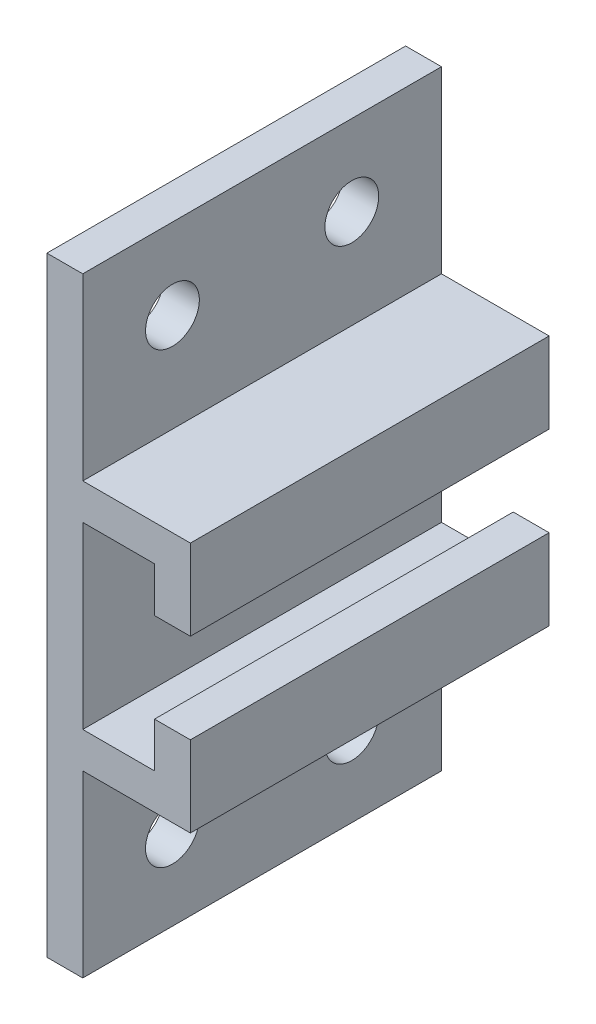
ISO-10303-21;
HEADER;
FILE_DESCRIPTION(('STEP AP214'),'2;1');
FILE_NAME('part.step','',(''),(''),'','','');
FILE_SCHEMA(('AUTOMOTIVE_DESIGN { 1 0 10303 214 1 1 1 1 }'));
ENDSEC;
DATA;
#1=APPLICATION_CONTEXT('core data for automotive mechanical design processes');
#2=APPLICATION_PROTOCOL_DEFINITION('international standard','automotive_design',2000,#1);
#3=PRODUCT_CONTEXT('',#1,'mechanical');
#4=PRODUCT('Part','Part','',(#3));
#5=PRODUCT_RELATED_PRODUCT_CATEGORY('part','',(#4));
#6=PRODUCT_DEFINITION_FORMATION('','',#4);
#7=PRODUCT_DEFINITION_CONTEXT('part definition',#1,'design');
#8=PRODUCT_DEFINITION('design','',#6,#7);
#9=PRODUCT_DEFINITION_SHAPE('','',#8);
#10=(LENGTH_UNIT() NAMED_UNIT(*) SI_UNIT(.MILLI.,.METRE.));
#11=(NAMED_UNIT(*) PLANE_ANGLE_UNIT() SI_UNIT($,.RADIAN.));
#12=(NAMED_UNIT(*) SI_UNIT($,.STERADIAN.) SOLID_ANGLE_UNIT());
#13=UNCERTAINTY_MEASURE_WITH_UNIT(LENGTH_MEASURE(1.E-05),#10,'distance_accuracy_value','');
#14=(GEOMETRIC_REPRESENTATION_CONTEXT(3) GLOBAL_UNCERTAINTY_ASSIGNED_CONTEXT((#13)) GLOBAL_UNIT_ASSIGNED_CONTEXT((#10,
#11,#12)) REPRESENTATION_CONTEXT('',''));
#15=CARTESIAN_POINT('',(0.,0.,0.));
#16=DIRECTION('',(0.,0.,1.));
#17=DIRECTION('',(1.,0.,0.));
#18=AXIS2_PLACEMENT_3D('',#15,#16,#17);
#19=CARTESIAN_POINT('',(0.,17.,20.));
#20=DIRECTION('',(0.,-1.,0.));
#21=DIRECTION('',(0.,0.,-1.));
#22=AXIS2_PLACEMENT_3D('',#19,#20,#21);
#23=PLANE('',#22);
#24=DIRECTION('',(-1.,0.,0.));
#25=VECTOR('',#24,1.);
#26=CARTESIAN_POINT('',(0.,17.,0.));
#27=LINE('',#26,#25);
#28=CARTESIAN_POINT('',(1.99999999999999,17.,0.));
#29=VERTEX_POINT('',#28);
#30=CARTESIAN_POINT('',(0.,17.,0.));
#31=VERTEX_POINT('',#30);
#32=EDGE_CURVE('E179',#29,#31,#27,.T.);
#33=ORIENTED_EDGE('',*,*,#32,.T.);
#34=DIRECTION('',(0.,0.,-1.));
#35=VECTOR('',#34,1.);
#36=CARTESIAN_POINT('',(0.,17.,20.));
#37=LINE('',#36,#35);
#38=CARTESIAN_POINT('',(0.,17.,20.));
#39=VERTEX_POINT('',#38);
#40=EDGE_CURVE('E11',#39,#31,#37,.T.);
#41=ORIENTED_EDGE('',*,*,#40,.F.);
#42=DIRECTION('',(-1.,0.,0.));
#43=VECTOR('',#42,1.);
#44=CARTESIAN_POINT('',(0.,17.,20.));
#45=LINE('',#44,#43);
#46=CARTESIAN_POINT('',(1.99999999999999,17.,20.));
#47=VERTEX_POINT('',#46);
#48=EDGE_CURVE('E210',#47,#39,#45,.T.);
#49=ORIENTED_EDGE('',*,*,#48,.F.);
#50=DIRECTION('',(0.,0.,-1.));
#51=VECTOR('',#50,1.);
#52=CARTESIAN_POINT('',(1.99999999999999,17.,20.));
#53=LINE('',#52,#51);
#54=EDGE_CURVE('E175',#47,#29,#53,.T.);
#55=ORIENTED_EDGE('',*,*,#54,.T.);
#56=EDGE_LOOP('',(#33,#41,#49,#55));
#57=FACE_BOUND('',#56,.T.);
#58=ADVANCED_FACE('F33',(#57),#23,.F.);
#59=CARTESIAN_POINT('',(0.,17.,20.));
#60=DIRECTION('',(1.,0.,0.));
#61=DIRECTION('',(0.,1.,0.));
#62=AXIS2_PLACEMENT_3D('',#59,#60,#61);
#63=PLANE('',#62);
#64=CARTESIAN_POINT('',(0.,-12.5,5.));
#65=DIRECTION('',(-1.,0.,0.));
#66=DIRECTION('',(0.,-1.,0.));
#67=AXIS2_PLACEMENT_3D('',#64,#65,#66);
#68=CIRCLE('',#67,1.5);
#69=CARTESIAN_POINT('',(0.,-14.,5.));
#70=VERTEX_POINT('',#69);
#71=EDGE_CURVE('E252',#70,#70,#68,.T.);
#72=ORIENTED_EDGE('',*,*,#71,.F.);
#73=EDGE_LOOP('',(#72));
#74=FACE_BOUND('',#73,.T.);
#75=CARTESIAN_POINT('',(0.,-12.5,15.));
#76=DIRECTION('',(-1.,0.,0.));
#77=DIRECTION('',(0.,-1.,0.));
#78=AXIS2_PLACEMENT_3D('',#75,#76,#77);
#79=CIRCLE('',#78,1.5);
#80=CARTESIAN_POINT('',(0.,-14.,15.));
#81=VERTEX_POINT('',#80);
#82=EDGE_CURVE('E451',#81,#81,#79,.T.);
#83=ORIENTED_EDGE('',*,*,#82,.F.);
#84=EDGE_LOOP('',(#83));
#85=FACE_BOUND('',#84,.T.);
#86=CARTESIAN_POINT('',(0.,12.5,15.));
#87=DIRECTION('',(-1.,0.,0.));
#88=DIRECTION('',(0.,-1.,0.));
#89=AXIS2_PLACEMENT_3D('',#86,#87,#88);
#90=CIRCLE('',#89,1.5);
#91=CARTESIAN_POINT('',(0.,11.,15.));
#92=VERTEX_POINT('',#91);
#93=EDGE_CURVE('E265',#92,#92,#90,.T.);
#94=ORIENTED_EDGE('',*,*,#93,.F.);
#95=EDGE_LOOP('',(#94));
#96=FACE_BOUND('',#95,.T.);
#97=CARTESIAN_POINT('',(0.,12.5,5.));
#98=DIRECTION('',(-1.,0.,0.));
#99=DIRECTION('',(0.,-1.,0.));
#100=AXIS2_PLACEMENT_3D('',#97,#98,#99);
#101=CIRCLE('',#100,1.5);
#102=CARTESIAN_POINT('',(0.,11.,5.));
#103=VERTEX_POINT('',#102);
#104=EDGE_CURVE('E248',#103,#103,#101,.T.);
#105=ORIENTED_EDGE('',*,*,#104,.F.);
#106=EDGE_LOOP('',(#105));
#107=FACE_BOUND('',#106,.T.);
#108=DIRECTION('',(0.,-1.,0.));
#109=VECTOR('',#108,1.);
#110=CARTESIAN_POINT('',(0.,17.,0.));
#111=LINE('',#110,#109);
#112=CARTESIAN_POINT('',(0.,-17.,0.));
#113=VERTEX_POINT('',#112);
#114=EDGE_CURVE('E182',#31,#113,#111,.T.);
#115=ORIENTED_EDGE('',*,*,#114,.T.);
#116=DIRECTION('',(0.,0.,-1.));
#117=VECTOR('',#116,1.);
#118=CARTESIAN_POINT('',(0.,-17.,20.));
#119=LINE('',#118,#117);
#120=CARTESIAN_POINT('',(0.,-17.,20.));
#121=VERTEX_POINT('',#120);
#122=EDGE_CURVE('E42',#121,#113,#119,.T.);
#123=ORIENTED_EDGE('',*,*,#122,.F.);
#124=DIRECTION('',(0.,-1.,0.));
#125=VECTOR('',#124,1.);
#126=CARTESIAN_POINT('',(0.,17.,20.));
#127=LINE('',#126,#125);
#128=EDGE_CURVE('E118',#39,#121,#127,.T.);
#129=ORIENTED_EDGE('',*,*,#128,.F.);
#130=ORIENTED_EDGE('',*,*,#40,.T.);
#131=EDGE_LOOP('',(#115,#123,#129,#130));
#132=FACE_BOUND('',#131,.T.);
#133=ADVANCED_FACE('F318',(#74,#85,#96,#107,#132),#63,.F.);
#134=CARTESIAN_POINT('',(0.,-17.,20.));
#135=DIRECTION('',(0.,1.,0.));
#136=DIRECTION('',(0.,0.,1.));
#137=AXIS2_PLACEMENT_3D('',#134,#135,#136);
#138=PLANE('',#137);
#139=DIRECTION('',(1.,0.,0.));
#140=VECTOR('',#139,1.);
#141=CARTESIAN_POINT('',(0.,-17.,0.));
#142=LINE('',#141,#140);
#143=CARTESIAN_POINT('',(2.,-17.,0.));
#144=VERTEX_POINT('',#143);
#145=EDGE_CURVE('E185',#113,#144,#142,.T.);
#146=ORIENTED_EDGE('',*,*,#145,.T.);
#147=DIRECTION('',(0.,0.,-1.));
#148=VECTOR('',#147,1.);
#149=CARTESIAN_POINT('',(2.,-17.,20.));
#150=LINE('',#149,#148);
#151=CARTESIAN_POINT('',(2.,-17.,20.));
#152=VERTEX_POINT('',#151);
#153=EDGE_CURVE('E241',#152,#144,#150,.T.);
#154=ORIENTED_EDGE('',*,*,#153,.F.);
#155=DIRECTION('',(1.,0.,0.));
#156=VECTOR('',#155,1.);
#157=CARTESIAN_POINT('',(0.,-17.,20.));
#158=LINE('',#157,#156);
#159=EDGE_CURVE('E269',#121,#152,#158,.T.);
#160=ORIENTED_EDGE('',*,*,#159,.F.);
#161=ORIENTED_EDGE('',*,*,#122,.T.);
#162=EDGE_LOOP('',(#146,#154,#160,#161));
#163=FACE_BOUND('',#162,.T.);
#164=ADVANCED_FACE('F322',(#163),#138,.F.);
#165=CARTESIAN_POINT('',(2.,-17.,20.));
#166=DIRECTION('',(-1.,0.,0.));
#167=DIRECTION('',(0.,0.,1.));
#168=AXIS2_PLACEMENT_3D('',#165,#166,#167);
#169=PLANE('',#168);
#170=CARTESIAN_POINT('',(2.,-12.5,5.));
#171=DIRECTION('',(-1.,0.,0.));
#172=DIRECTION('',(0.,0.,1.));
#173=AXIS2_PLACEMENT_3D('',#170,#171,#172);
#174=CIRCLE('',#173,1.5);
#175=CARTESIAN_POINT('',(2.,-12.5,6.5));
#176=VERTEX_POINT('',#175);
#177=EDGE_CURVE('E36',#176,#176,#174,.T.);
#178=ORIENTED_EDGE('',*,*,#177,.T.);
#179=EDGE_LOOP('',(#178));
#180=FACE_BOUND('',#179,.T.);
#181=CARTESIAN_POINT('',(2.,-12.5,15.));
#182=DIRECTION('',(-1.,0.,0.));
#183=DIRECTION('',(0.,0.,1.));
#184=AXIS2_PLACEMENT_3D('',#181,#182,#183);
#185=CIRCLE('',#184,1.5);
#186=CARTESIAN_POINT('',(2.,-12.5,16.5));
#187=VERTEX_POINT('',#186);
#188=EDGE_CURVE('E251',#187,#187,#185,.T.);
#189=ORIENTED_EDGE('',*,*,#188,.T.);
#190=EDGE_LOOP('',(#189));
#191=FACE_BOUND('',#190,.T.);
#192=DIRECTION('',(0.,1.,0.));
#193=VECTOR('',#192,1.);
#194=CARTESIAN_POINT('',(2.,-17.,0.));
#195=LINE('',#194,#193);
#196=CARTESIAN_POINT('',(2.,-7.,0.));
#197=VERTEX_POINT('',#196);
#198=EDGE_CURVE('E187',#144,#197,#195,.T.);
#199=ORIENTED_EDGE('',*,*,#198,.T.);
#200=DIRECTION('',(0.,0.,-1.));
#201=VECTOR('',#200,1.);
#202=CARTESIAN_POINT('',(2.,-7.,20.));
#203=LINE('',#202,#201);
#204=CARTESIAN_POINT('',(2.,-7.,20.));
#205=VERTEX_POINT('',#204);
#206=EDGE_CURVE('E238',#205,#197,#203,.T.);
#207=ORIENTED_EDGE('',*,*,#206,.F.);
#208=DIRECTION('',(0.,1.,0.));
#209=VECTOR('',#208,1.);
#210=CARTESIAN_POINT('',(2.,-17.,20.));
#211=LINE('',#210,#209);
#212=EDGE_CURVE('E271',#152,#205,#211,.T.);
#213=ORIENTED_EDGE('',*,*,#212,.F.);
#214=ORIENTED_EDGE('',*,*,#153,.T.);
#215=EDGE_LOOP('',(#199,#207,#213,#214));
#216=FACE_BOUND('',#215,.T.);
#217=ADVANCED_FACE('F327',(#180,#191,#216),#169,.F.);
#218=CARTESIAN_POINT('',(2.,-7.,20.));
#219=DIRECTION('',(0.,1.,0.));
#220=DIRECTION('',(0.,0.,1.));
#221=AXIS2_PLACEMENT_3D('',#218,#219,#220);
#222=PLANE('',#221);
#223=DIRECTION('',(1.,0.,0.));
#224=VECTOR('',#223,1.);
#225=CARTESIAN_POINT('',(2.,-7.,0.));
#226=LINE('',#225,#224);
#227=CARTESIAN_POINT('',(8.,-7.,0.));
#228=VERTEX_POINT('',#227);
#229=EDGE_CURVE('E189',#197,#228,#226,.T.);
#230=ORIENTED_EDGE('',*,*,#229,.T.);
#231=DIRECTION('',(0.,0.,-1.));
#232=VECTOR('',#231,1.);
#233=CARTESIAN_POINT('',(8.,-7.,20.));
#234=LINE('',#233,#232);
#235=CARTESIAN_POINT('',(8.,-7.,20.));
#236=VERTEX_POINT('',#235);
#237=EDGE_CURVE('E235',#236,#228,#234,.T.);
#238=ORIENTED_EDGE('',*,*,#237,.F.);
#239=DIRECTION('',(1.,0.,0.));
#240=VECTOR('',#239,1.);
#241=CARTESIAN_POINT('',(2.,-7.,20.));
#242=LINE('',#241,#240);
#243=EDGE_CURVE('E273',#205,#236,#242,.T.);
#244=ORIENTED_EDGE('',*,*,#243,.F.);
#245=ORIENTED_EDGE('',*,*,#206,.T.);
#246=EDGE_LOOP('',(#230,#238,#244,#245));
#247=FACE_BOUND('',#246,.T.);
#248=ADVANCED_FACE('F335',(#247),#222,.F.);
#249=CARTESIAN_POINT('',(8.,-7.,20.));
#250=DIRECTION('',(-1.,0.,0.));
#251=DIRECTION('',(0.,0.,1.));
#252=AXIS2_PLACEMENT_3D('',#249,#250,#251);
#253=PLANE('',#252);
#254=DIRECTION('',(0.,1.,0.));
#255=VECTOR('',#254,1.);
#256=CARTESIAN_POINT('',(8.,-7.,0.));
#257=LINE('',#256,#255);
#258=CARTESIAN_POINT('',(8.,-2.5,0.));
#259=VERTEX_POINT('',#258);
#260=EDGE_CURVE('E191',#228,#259,#257,.T.);
#261=ORIENTED_EDGE('',*,*,#260,.T.);
#262=DIRECTION('',(0.,0.,-1.));
#263=VECTOR('',#262,1.);
#264=CARTESIAN_POINT('',(8.,-2.5,20.));
#265=LINE('',#264,#263);
#266=CARTESIAN_POINT('',(8.,-2.5,20.));
#267=VERTEX_POINT('',#266);
#268=EDGE_CURVE('E232',#267,#259,#265,.T.);
#269=ORIENTED_EDGE('',*,*,#268,.F.);
#270=DIRECTION('',(0.,1.,0.));
#271=VECTOR('',#270,1.);
#272=CARTESIAN_POINT('',(8.,-7.,20.));
#273=LINE('',#272,#271);
#274=EDGE_CURVE('E275',#236,#267,#273,.T.);
#275=ORIENTED_EDGE('',*,*,#274,.F.);
#276=ORIENTED_EDGE('',*,*,#237,.T.);
#277=EDGE_LOOP('',(#261,#269,#275,#276));
#278=FACE_BOUND('',#277,.T.);
#279=ADVANCED_FACE('F338',(#278),#253,.F.);
#280=CARTESIAN_POINT('',(8.,-2.5,20.));
#281=DIRECTION('',(0.,-1.,0.));
#282=DIRECTION('',(1.,0.,0.));
#283=AXIS2_PLACEMENT_3D('',#280,#281,#282);
#284=PLANE('',#283);
#285=DIRECTION('',(-1.,0.,0.));
#286=VECTOR('',#285,1.);
#287=CARTESIAN_POINT('',(8.,-2.5,0.));
#288=LINE('',#287,#286);
#289=CARTESIAN_POINT('',(6.,-2.5,0.));
#290=VERTEX_POINT('',#289);
#291=EDGE_CURVE('E193',#259,#290,#288,.T.);
#292=ORIENTED_EDGE('',*,*,#291,.T.);
#293=DIRECTION('',(0.,0.,-1.));
#294=VECTOR('',#293,1.);
#295=CARTESIAN_POINT('',(6.,-2.5,20.));
#296=LINE('',#295,#294);
#297=CARTESIAN_POINT('',(6.,-2.5,20.));
#298=VERTEX_POINT('',#297);
#299=EDGE_CURVE('E229',#298,#290,#296,.T.);
#300=ORIENTED_EDGE('',*,*,#299,.F.);
#301=DIRECTION('',(-1.,0.,0.));
#302=VECTOR('',#301,1.);
#303=CARTESIAN_POINT('',(8.,-2.5,20.));
#304=LINE('',#303,#302);
#305=EDGE_CURVE('E277',#267,#298,#304,.T.);
#306=ORIENTED_EDGE('',*,*,#305,.F.);
#307=ORIENTED_EDGE('',*,*,#268,.T.);
#308=EDGE_LOOP('',(#292,#300,#306,#307));
#309=FACE_BOUND('',#308,.T.);
#310=ADVANCED_FACE('F342',(#309),#284,.F.);
#311=CARTESIAN_POINT('',(6.,-2.5,20.));
#312=DIRECTION('',(1.,0.,0.));
#313=DIRECTION('',(0.,1.,0.));
#314=AXIS2_PLACEMENT_3D('',#311,#312,#313);
#315=PLANE('',#314);
#316=DIRECTION('',(0.,-1.,0.));
#317=VECTOR('',#316,1.);
#318=CARTESIAN_POINT('',(6.,-2.5,0.));
#319=LINE('',#318,#317);
#320=CARTESIAN_POINT('',(6.,-5.,0.));
#321=VERTEX_POINT('',#320);
#322=EDGE_CURVE('E195',#290,#321,#319,.T.);
#323=ORIENTED_EDGE('',*,*,#322,.T.);
#324=DIRECTION('',(0.,0.,-1.));
#325=VECTOR('',#324,1.);
#326=CARTESIAN_POINT('',(6.,-5.,20.));
#327=LINE('',#326,#325);
#328=CARTESIAN_POINT('',(6.,-5.,20.));
#329=VERTEX_POINT('',#328);
#330=EDGE_CURVE('E226',#329,#321,#327,.T.);
#331=ORIENTED_EDGE('',*,*,#330,.F.);
#332=DIRECTION('',(0.,-1.,0.));
#333=VECTOR('',#332,1.);
#334=CARTESIAN_POINT('',(6.,-2.5,20.));
#335=LINE('',#334,#333);
#336=EDGE_CURVE('E279',#298,#329,#335,.T.);
#337=ORIENTED_EDGE('',*,*,#336,.F.);
#338=ORIENTED_EDGE('',*,*,#299,.T.);
#339=EDGE_LOOP('',(#323,#331,#337,#338));
#340=FACE_BOUND('',#339,.T.);
#341=ADVANCED_FACE('F346',(#340),#315,.F.);
#342=CARTESIAN_POINT('',(6.,-5.,20.));
#343=DIRECTION('',(0.,-1.,0.));
#344=DIRECTION('',(1.,0.,0.));
#345=AXIS2_PLACEMENT_3D('',#342,#343,#344);
#346=PLANE('',#345);
#347=DIRECTION('',(-1.,0.,0.));
#348=VECTOR('',#347,1.);
#349=CARTESIAN_POINT('',(6.,-5.,0.));
#350=LINE('',#349,#348);
#351=CARTESIAN_POINT('',(2.,-5.,0.));
#352=VERTEX_POINT('',#351);
#353=EDGE_CURVE('E197',#321,#352,#350,.T.);
#354=ORIENTED_EDGE('',*,*,#353,.T.);
#355=DIRECTION('',(0.,0.,-1.));
#356=VECTOR('',#355,1.);
#357=CARTESIAN_POINT('',(2.,-5.,20.));
#358=LINE('',#357,#356);
#359=CARTESIAN_POINT('',(2.,-5.,20.));
#360=VERTEX_POINT('',#359);
#361=EDGE_CURVE('E223',#360,#352,#358,.T.);
#362=ORIENTED_EDGE('',*,*,#361,.F.);
#363=DIRECTION('',(-1.,0.,0.));
#364=VECTOR('',#363,1.);
#365=CARTESIAN_POINT('',(6.,-5.,20.));
#366=LINE('',#365,#364);
#367=EDGE_CURVE('E281',#329,#360,#366,.T.);
#368=ORIENTED_EDGE('',*,*,#367,.F.);
#369=ORIENTED_EDGE('',*,*,#330,.T.);
#370=EDGE_LOOP('',(#354,#362,#368,#369));
#371=FACE_BOUND('',#370,.T.);
#372=ADVANCED_FACE('F350',(#371),#346,.F.);
#373=CARTESIAN_POINT('',(2.,-5.,20.));
#374=DIRECTION('',(-1.,0.,0.));
#375=DIRECTION('',(0.,-1.,0.));
#376=AXIS2_PLACEMENT_3D('',#373,#374,#375);
#377=PLANE('',#376);
#378=DIRECTION('',(0.,1.,0.));
#379=VECTOR('',#378,1.);
#380=CARTESIAN_POINT('',(2.,-5.,0.));
#381=LINE('',#380,#379);
#382=CARTESIAN_POINT('',(2.,5.,0.));
#383=VERTEX_POINT('',#382);
#384=EDGE_CURVE('E199',#352,#383,#381,.T.);
#385=ORIENTED_EDGE('',*,*,#384,.T.);
#386=DIRECTION('',(0.,0.,-1.));
#387=VECTOR('',#386,1.);
#388=CARTESIAN_POINT('',(2.,5.,20.));
#389=LINE('',#388,#387);
#390=CARTESIAN_POINT('',(2.,5.,20.));
#391=VERTEX_POINT('',#390);
#392=EDGE_CURVE('E220',#391,#383,#389,.T.);
#393=ORIENTED_EDGE('',*,*,#392,.F.);
#394=DIRECTION('',(0.,1.,0.));
#395=VECTOR('',#394,1.);
#396=CARTESIAN_POINT('',(2.,-5.,20.));
#397=LINE('',#396,#395);
#398=EDGE_CURVE('E283',#360,#391,#397,.T.);
#399=ORIENTED_EDGE('',*,*,#398,.F.);
#400=ORIENTED_EDGE('',*,*,#361,.T.);
#401=EDGE_LOOP('',(#385,#393,#399,#400));
#402=FACE_BOUND('',#401,.T.);
#403=ADVANCED_FACE('F354',(#402),#377,.F.);
#404=CARTESIAN_POINT('',(2.,5.,20.));
#405=DIRECTION('',(0.,1.,0.));
#406=DIRECTION('',(0.,0.,1.));
#407=AXIS2_PLACEMENT_3D('',#404,#405,#406);
#408=PLANE('',#407);
#409=DIRECTION('',(1.,0.,0.));
#410=VECTOR('',#409,1.);
#411=CARTESIAN_POINT('',(2.,5.,0.));
#412=LINE('',#411,#410);
#413=CARTESIAN_POINT('',(6.,5.,0.));
#414=VERTEX_POINT('',#413);
#415=EDGE_CURVE('E201',#383,#414,#412,.T.);
#416=ORIENTED_EDGE('',*,*,#415,.T.);
#417=DIRECTION('',(0.,0.,-1.));
#418=VECTOR('',#417,1.);
#419=CARTESIAN_POINT('',(6.,5.,20.));
#420=LINE('',#419,#418);
#421=CARTESIAN_POINT('',(6.,5.,20.));
#422=VERTEX_POINT('',#421);
#423=EDGE_CURVE('E217',#422,#414,#420,.T.);
#424=ORIENTED_EDGE('',*,*,#423,.F.);
#425=DIRECTION('',(1.,0.,0.));
#426=VECTOR('',#425,1.);
#427=CARTESIAN_POINT('',(2.,5.,20.));
#428=LINE('',#427,#426);
#429=EDGE_CURVE('E285',#391,#422,#428,.T.);
#430=ORIENTED_EDGE('',*,*,#429,.F.);
#431=ORIENTED_EDGE('',*,*,#392,.T.);
#432=EDGE_LOOP('',(#416,#424,#430,#431));
#433=FACE_BOUND('',#432,.T.);
#434=ADVANCED_FACE('F358',(#433),#408,.F.);
#435=CARTESIAN_POINT('',(6.,5.,20.));
#436=DIRECTION('',(1.,0.,0.));
#437=DIRECTION('',(0.,1.,0.));
#438=AXIS2_PLACEMENT_3D('',#435,#436,#437);
#439=PLANE('',#438);
#440=DIRECTION('',(0.,-1.,0.));
#441=VECTOR('',#440,1.);
#442=CARTESIAN_POINT('',(6.,5.,0.));
#443=LINE('',#442,#441);
#444=CARTESIAN_POINT('',(6.,2.5,0.));
#445=VERTEX_POINT('',#444);
#446=EDGE_CURVE('E203',#414,#445,#443,.T.);
#447=ORIENTED_EDGE('',*,*,#446,.T.);
#448=DIRECTION('',(0.,0.,-1.));
#449=VECTOR('',#448,1.);
#450=CARTESIAN_POINT('',(6.,2.5,20.));
#451=LINE('',#450,#449);
#452=CARTESIAN_POINT('',(6.,2.5,20.));
#453=VERTEX_POINT('',#452);
#454=EDGE_CURVE('E214',#453,#445,#451,.T.);
#455=ORIENTED_EDGE('',*,*,#454,.F.);
#456=DIRECTION('',(0.,-1.,0.));
#457=VECTOR('',#456,1.);
#458=CARTESIAN_POINT('',(6.,5.,20.));
#459=LINE('',#458,#457);
#460=EDGE_CURVE('E287',#422,#453,#459,.T.);
#461=ORIENTED_EDGE('',*,*,#460,.F.);
#462=ORIENTED_EDGE('',*,*,#423,.T.);
#463=EDGE_LOOP('',(#447,#455,#461,#462));
#464=FACE_BOUND('',#463,.T.);
#465=ADVANCED_FACE('F293',(#464),#439,.F.);
#466=CARTESIAN_POINT('',(6.,2.5,20.));
#467=DIRECTION('',(0.,1.,0.));
#468=DIRECTION('',(-1.,0.,0.));
#469=AXIS2_PLACEMENT_3D('',#466,#467,#468);
#470=PLANE('',#469);
#471=DIRECTION('',(1.,0.,0.));
#472=VECTOR('',#471,1.);
#473=CARTESIAN_POINT('',(6.,2.5,0.));
#474=LINE('',#473,#472);
#475=CARTESIAN_POINT('',(8.,2.5,0.));
#476=VERTEX_POINT('',#475);
#477=EDGE_CURVE('E205',#445,#476,#474,.T.);
#478=ORIENTED_EDGE('',*,*,#477,.T.);
#479=DIRECTION('',(0.,0.,-1.));
#480=VECTOR('',#479,1.);
#481=CARTESIAN_POINT('',(8.,2.5,20.));
#482=LINE('',#481,#480);
#483=CARTESIAN_POINT('',(8.,2.5,20.));
#484=VERTEX_POINT('',#483);
#485=EDGE_CURVE('E170',#484,#476,#482,.T.);
#486=ORIENTED_EDGE('',*,*,#485,.F.);
#487=DIRECTION('',(1.,0.,0.));
#488=VECTOR('',#487,1.);
#489=CARTESIAN_POINT('',(6.,2.5,20.));
#490=LINE('',#489,#488);
#491=EDGE_CURVE('E161',#453,#484,#490,.T.);
#492=ORIENTED_EDGE('',*,*,#491,.F.);
#493=ORIENTED_EDGE('',*,*,#454,.T.);
#494=EDGE_LOOP('',(#478,#486,#492,#493));
#495=FACE_BOUND('',#494,.T.);
#496=ADVANCED_FACE('F297',(#495),#470,.F.);
#497=CARTESIAN_POINT('',(8.,2.5,20.));
#498=DIRECTION('',(-1.,0.,0.));
#499=DIRECTION('',(0.,-1.,0.));
#500=AXIS2_PLACEMENT_3D('',#497,#498,#499);
#501=PLANE('',#500);
#502=DIRECTION('',(0.,1.,0.));
#503=VECTOR('',#502,1.);
#504=CARTESIAN_POINT('',(8.,2.5,0.));
#505=LINE('',#504,#503);
#506=CARTESIAN_POINT('',(8.,7.,0.));
#507=VERTEX_POINT('',#506);
#508=EDGE_CURVE('E169',#476,#507,#505,.T.);
#509=ORIENTED_EDGE('',*,*,#508,.T.);
#510=DIRECTION('',(0.,0.,-1.));
#511=VECTOR('',#510,1.);
#512=CARTESIAN_POINT('',(8.,7.,20.));
#513=LINE('',#512,#511);
#514=CARTESIAN_POINT('',(8.,7.,20.));
#515=VERTEX_POINT('',#514);
#516=EDGE_CURVE('E166',#515,#507,#513,.T.);
#517=ORIENTED_EDGE('',*,*,#516,.F.);
#518=DIRECTION('',(0.,1.,0.));
#519=VECTOR('',#518,1.);
#520=CARTESIAN_POINT('',(8.,2.5,20.));
#521=LINE('',#520,#519);
#522=EDGE_CURVE('E155',#484,#515,#521,.T.);
#523=ORIENTED_EDGE('',*,*,#522,.F.);
#524=ORIENTED_EDGE('',*,*,#485,.T.);
#525=EDGE_LOOP('',(#509,#517,#523,#524));
#526=FACE_BOUND('',#525,.T.);
#527=ADVANCED_FACE('F167',(#526),#501,.F.);
#528=CARTESIAN_POINT('',(2.,7.,20.));
#529=DIRECTION('',(0.,-1.,0.));
#530=DIRECTION('',(1.,0.,0.));
#531=AXIS2_PLACEMENT_3D('',#528,#529,#530);
#532=PLANE('',#531);
#533=DIRECTION('',(-1.,0.,0.));
#534=VECTOR('',#533,1.);
#535=CARTESIAN_POINT('',(2.,7.,0.));
#536=LINE('',#535,#534);
#537=CARTESIAN_POINT('',(2.,7.,0.));
#538=VERTEX_POINT('',#537);
#539=EDGE_CURVE('E104',#507,#538,#536,.T.);
#540=ORIENTED_EDGE('',*,*,#539,.T.);
#541=DIRECTION('',(0.,0.,-1.));
#542=VECTOR('',#541,1.);
#543=CARTESIAN_POINT('',(2.,7.,20.));
#544=LINE('',#543,#542);
#545=CARTESIAN_POINT('',(2.,7.,20.));
#546=VERTEX_POINT('',#545);
#547=EDGE_CURVE('E171',#546,#538,#544,.T.);
#548=ORIENTED_EDGE('',*,*,#547,.F.);
#549=DIRECTION('',(-1.,0.,0.));
#550=VECTOR('',#549,1.);
#551=CARTESIAN_POINT('',(2.,7.,20.));
#552=LINE('',#551,#550);
#553=EDGE_CURVE('E159',#515,#546,#552,.T.);
#554=ORIENTED_EDGE('',*,*,#553,.F.);
#555=ORIENTED_EDGE('',*,*,#516,.T.);
#556=EDGE_LOOP('',(#540,#548,#554,#555));
#557=FACE_BOUND('',#556,.T.);
#558=ADVANCED_FACE('F173',(#557),#532,.F.);
#559=CARTESIAN_POINT('',(1.99999999999999,17.,20.));
#560=DIRECTION('',(-1.,0.,0.));
#561=DIRECTION('',(0.,-1.,0.));
#562=AXIS2_PLACEMENT_3D('',#559,#560,#561);
#563=PLANE('',#562);
#564=CARTESIAN_POINT('',(2.,12.5,15.));
#565=DIRECTION('',(-1.,0.,0.));
#566=DIRECTION('',(0.,-1.,0.));
#567=AXIS2_PLACEMENT_3D('',#564,#565,#566);
#568=CIRCLE('',#567,1.5);
#569=CARTESIAN_POINT('',(2.,11.,15.));
#570=VERTEX_POINT('',#569);
#571=EDGE_CURVE('E249',#570,#570,#568,.T.);
#572=ORIENTED_EDGE('',*,*,#571,.T.);
#573=EDGE_LOOP('',(#572));
#574=FACE_BOUND('',#573,.T.);
#575=CARTESIAN_POINT('',(2.,12.5,5.));
#576=DIRECTION('',(-1.,0.,0.));
#577=DIRECTION('',(0.,-1.,0.));
#578=AXIS2_PLACEMENT_3D('',#575,#576,#577);
#579=CIRCLE('',#578,1.5);
#580=CARTESIAN_POINT('',(2.,11.,5.));
#581=VERTEX_POINT('',#580);
#582=EDGE_CURVE('E183',#581,#581,#579,.T.);
#583=ORIENTED_EDGE('',*,*,#582,.T.);
#584=EDGE_LOOP('',(#583));
#585=FACE_BOUND('',#584,.T.);
#586=DIRECTION('',(0.,1.,0.));
#587=VECTOR('',#586,1.);
#588=CARTESIAN_POINT('',(1.99999999999999,17.,0.));
#589=LINE('',#588,#587);
#590=EDGE_CURVE('E110',#538,#29,#589,.T.);
#591=ORIENTED_EDGE('',*,*,#590,.T.);
#592=ORIENTED_EDGE('',*,*,#54,.F.);
#593=DIRECTION('',(0.,1.,0.));
#594=VECTOR('',#593,1.);
#595=CARTESIAN_POINT('',(1.99999999999999,17.,20.));
#596=LINE('',#595,#594);
#597=EDGE_CURVE('E51',#546,#47,#596,.T.);
#598=ORIENTED_EDGE('',*,*,#597,.F.);
#599=ORIENTED_EDGE('',*,*,#547,.T.);
#600=EDGE_LOOP('',(#591,#592,#598,#599));
#601=FACE_BOUND('',#600,.T.);
#602=ADVANCED_FACE('F305',(#574,#585,#601),#563,.F.);
#603=CARTESIAN_POINT('',(0.,0.,20.));
#604=DIRECTION('',(0.,0.,-1.));
#605=DIRECTION('',(-1.,0.,0.));
#606=AXIS2_PLACEMENT_3D('',#603,#604,#605);
#607=PLANE('',#606);
#608=ORIENTED_EDGE('',*,*,#48,.T.);
#609=ORIENTED_EDGE('',*,*,#128,.T.);
#610=ORIENTED_EDGE('',*,*,#159,.T.);
#611=ORIENTED_EDGE('',*,*,#212,.T.);
#612=ORIENTED_EDGE('',*,*,#243,.T.);
#613=ORIENTED_EDGE('',*,*,#274,.T.);
#614=ORIENTED_EDGE('',*,*,#305,.T.);
#615=ORIENTED_EDGE('',*,*,#336,.T.);
#616=ORIENTED_EDGE('',*,*,#367,.T.);
#617=ORIENTED_EDGE('',*,*,#398,.T.);
#618=ORIENTED_EDGE('',*,*,#429,.T.);
#619=ORIENTED_EDGE('',*,*,#460,.T.);
#620=ORIENTED_EDGE('',*,*,#491,.T.);
#621=ORIENTED_EDGE('',*,*,#522,.T.);
#622=ORIENTED_EDGE('',*,*,#553,.T.);
#623=ORIENTED_EDGE('',*,*,#597,.T.);
#624=EDGE_LOOP('',(#608,#609,#610,#611,#612,#613,#614,#615,#616,#617,#618,#619,#620,#621,#622,#623));
#625=FACE_BOUND('',#624,.T.);
#626=ADVANCED_FACE('F157',(#625),#607,.F.);
#627=CARTESIAN_POINT('',(0.,0.,0.));
#628=DIRECTION('',(0.,0.,-1.));
#629=DIRECTION('',(-1.,0.,0.));
#630=AXIS2_PLACEMENT_3D('',#627,#628,#629);
#631=PLANE('',#630);
#632=ORIENTED_EDGE('',*,*,#32,.F.);
#633=ORIENTED_EDGE('',*,*,#590,.F.);
#634=ORIENTED_EDGE('',*,*,#539,.F.);
#635=ORIENTED_EDGE('',*,*,#508,.F.);
#636=ORIENTED_EDGE('',*,*,#477,.F.);
#637=ORIENTED_EDGE('',*,*,#446,.F.);
#638=ORIENTED_EDGE('',*,*,#415,.F.);
#639=ORIENTED_EDGE('',*,*,#384,.F.);
#640=ORIENTED_EDGE('',*,*,#353,.F.);
#641=ORIENTED_EDGE('',*,*,#322,.F.);
#642=ORIENTED_EDGE('',*,*,#291,.F.);
#643=ORIENTED_EDGE('',*,*,#260,.F.);
#644=ORIENTED_EDGE('',*,*,#229,.F.);
#645=ORIENTED_EDGE('',*,*,#198,.F.);
#646=ORIENTED_EDGE('',*,*,#145,.F.);
#647=ORIENTED_EDGE('',*,*,#114,.F.);
#648=EDGE_LOOP('',(#632,#633,#634,#635,#636,#637,#638,#639,#640,#641,#642,#643,#644,#645,#646,#647));
#649=FACE_BOUND('',#648,.T.);
#650=ADVANCED_FACE('F300',(#649),#631,.T.);
#651=CARTESIAN_POINT('',(8.00000000000001,12.5,5.));
#652=DIRECTION('',(-1.,0.,0.));
#653=DIRECTION('',(0.,-1.,0.));
#654=AXIS2_PLACEMENT_3D('',#651,#652,#653);
#655=CYLINDRICAL_SURFACE('',#654,1.5);
#656=ORIENTED_EDGE('',*,*,#104,.T.);
#657=EDGE_LOOP('',(#656));
#658=FACE_BOUND('',#657,.T.);
#659=ORIENTED_EDGE('',*,*,#582,.F.);
#660=EDGE_LOOP('',(#659));
#661=FACE_BOUND('',#660,.T.);
#662=ADVANCED_FACE('F391',(#658,#661),#655,.F.);
#663=CARTESIAN_POINT('',(8.00000000000001,12.5,15.));
#664=DIRECTION('',(-1.,0.,0.));
#665=DIRECTION('',(0.,-1.,0.));
#666=AXIS2_PLACEMENT_3D('',#663,#664,#665);
#667=CYLINDRICAL_SURFACE('',#666,1.5);
#668=ORIENTED_EDGE('',*,*,#93,.T.);
#669=EDGE_LOOP('',(#668));
#670=FACE_BOUND('',#669,.T.);
#671=ORIENTED_EDGE('',*,*,#571,.F.);
#672=EDGE_LOOP('',(#671));
#673=FACE_BOUND('',#672,.T.);
#674=ADVANCED_FACE('F416',(#670,#673),#667,.F.);
#675=CARTESIAN_POINT('',(8.00000000000001,-12.5,15.));
#676=DIRECTION('',(-1.,0.,0.));
#677=DIRECTION('',(0.,-1.,0.));
#678=AXIS2_PLACEMENT_3D('',#675,#676,#677);
#679=CYLINDRICAL_SURFACE('',#678,1.5);
#680=ORIENTED_EDGE('',*,*,#82,.T.);
#681=EDGE_LOOP('',(#680));
#682=FACE_BOUND('',#681,.T.);
#683=ORIENTED_EDGE('',*,*,#188,.F.);
#684=EDGE_LOOP('',(#683));
#685=FACE_BOUND('',#684,.T.);
#686=ADVANCED_FACE('F425',(#682,#685),#679,.F.);
#687=CARTESIAN_POINT('',(8.00000000000001,-12.5,5.));
#688=DIRECTION('',(-1.,0.,0.));
#689=DIRECTION('',(0.,-1.,0.));
#690=AXIS2_PLACEMENT_3D('',#687,#688,#689);
#691=CYLINDRICAL_SURFACE('',#690,1.5);
#692=ORIENTED_EDGE('',*,*,#71,.T.);
#693=EDGE_LOOP('',(#692));
#694=FACE_BOUND('',#693,.T.);
#695=ORIENTED_EDGE('',*,*,#177,.F.);
#696=EDGE_LOOP('',(#695));
#697=FACE_BOUND('',#696,.T.);
#698=ADVANCED_FACE('F435',(#694,#697),#691,.F.);
#699=CLOSED_SHELL('',(#58,#133,#164,#217,#248,#279,#310,#341,#372,#403,#434,#465,#496,#527,#558,
#602,#626,#650,#662,#674,#686,#698));
#700=MANIFOLD_SOLID_BREP('B2',#699);
#701=ADVANCED_BREP_SHAPE_REPRESENTATION('',(#18,#700),#14);
#702=SHAPE_DEFINITION_REPRESENTATION(#9,#701);
ENDSEC;
END-ISO-10303-21;
